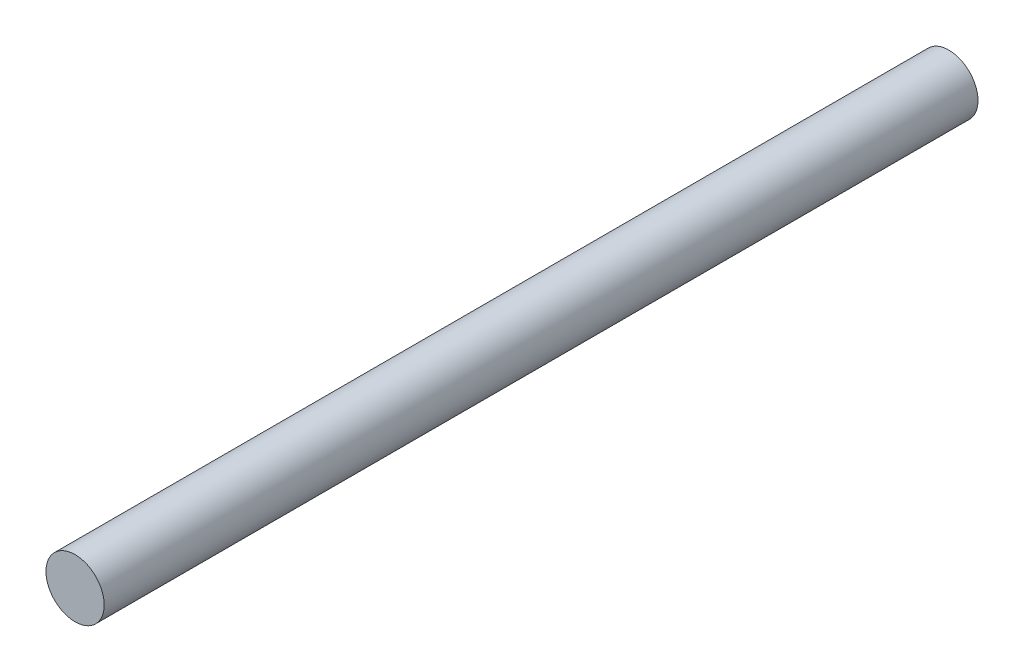
ISO-10303-21;
HEADER;
FILE_DESCRIPTION(('STEP AP214'),'2;1');
FILE_NAME('part.step','',(''),(''),'','','');
FILE_SCHEMA(('AUTOMOTIVE_DESIGN { 1 0 10303 214 1 1 1 1 }'));
ENDSEC;
DATA;
#1=APPLICATION_CONTEXT('core data for automotive mechanical design processes');
#2=APPLICATION_PROTOCOL_DEFINITION('international standard','automotive_design',2000,#1);
#3=PRODUCT_CONTEXT('',#1,'mechanical');
#4=PRODUCT('Part','Part','',(#3));
#5=PRODUCT_RELATED_PRODUCT_CATEGORY('part','',(#4));
#6=PRODUCT_DEFINITION_FORMATION('','',#4);
#7=PRODUCT_DEFINITION_CONTEXT('part definition',#1,'design');
#8=PRODUCT_DEFINITION('design','',#6,#7);
#9=PRODUCT_DEFINITION_SHAPE('','',#8);
#10=(LENGTH_UNIT() NAMED_UNIT(*) SI_UNIT(.MILLI.,.METRE.));
#11=(NAMED_UNIT(*) PLANE_ANGLE_UNIT() SI_UNIT($,.RADIAN.));
#12=(NAMED_UNIT(*) SI_UNIT($,.STERADIAN.) SOLID_ANGLE_UNIT());
#13=UNCERTAINTY_MEASURE_WITH_UNIT(LENGTH_MEASURE(1.E-05),#10,'distance_accuracy_value','');
#14=(GEOMETRIC_REPRESENTATION_CONTEXT(3) GLOBAL_UNCERTAINTY_ASSIGNED_CONTEXT((#13)) GLOBAL_UNIT_ASSIGNED_CONTEXT((#10,
#11,#12)) REPRESENTATION_CONTEXT('',''));
#15=CARTESIAN_POINT('',(0.,0.,0.));
#16=DIRECTION('',(0.,0.,1.));
#17=DIRECTION('',(1.,0.,0.));
#18=AXIS2_PLACEMENT_3D('',#15,#16,#17);
#19=CARTESIAN_POINT('',(0.,0.,45.));
#20=DIRECTION('',(0.,0.,-1.));
#21=DIRECTION('',(-1.,0.,0.));
#22=AXIS2_PLACEMENT_3D('',#19,#20,#21);
#23=CYLINDRICAL_SURFACE('',#22,1.5);
#24=CARTESIAN_POINT('',(0.,0.,45.));
#25=DIRECTION('',(0.,0.,1.));
#26=DIRECTION('',(1.,0.,0.));
#27=AXIS2_PLACEMENT_3D('',#24,#25,#26);
#28=CIRCLE('',#27,1.5);
#29=CARTESIAN_POINT('',(1.5,0.,45.));
#30=VERTEX_POINT('',#29);
#31=EDGE_CURVE('E10',#30,#30,#28,.T.);
#32=ORIENTED_EDGE('',*,*,#31,.F.);
#33=EDGE_LOOP('',(#32));
#34=FACE_BOUND('',#33,.T.);
#35=CARTESIAN_POINT('',(0.,0.,0.));
#36=DIRECTION('',(0.,0.,1.));
#37=DIRECTION('',(1.,0.,0.));
#38=AXIS2_PLACEMENT_3D('',#35,#36,#37);
#39=CIRCLE('',#38,1.5);
#40=CARTESIAN_POINT('',(1.5,0.,0.));
#41=VERTEX_POINT('',#40);
#42=EDGE_CURVE('E40',#41,#41,#39,.T.);
#43=ORIENTED_EDGE('',*,*,#42,.T.);
#44=EDGE_LOOP('',(#43));
#45=FACE_BOUND('',#44,.T.);
#46=ADVANCED_FACE('F37',(#34,#45),#23,.T.);
#47=CARTESIAN_POINT('',(0.,0.,45.));
#48=DIRECTION('',(0.,0.,1.));
#49=DIRECTION('',(1.,0.,0.));
#50=AXIS2_PLACEMENT_3D('',#47,#48,#49);
#51=PLANE('',#50);
#52=ORIENTED_EDGE('',*,*,#31,.T.);
#53=EDGE_LOOP('',(#52));
#54=FACE_BOUND('',#53,.T.);
#55=ADVANCED_FACE('F54',(#54),#51,.T.);
#56=CARTESIAN_POINT('',(0.,0.,0.));
#57=DIRECTION('',(0.,0.,1.));
#58=DIRECTION('',(1.,0.,0.));
#59=AXIS2_PLACEMENT_3D('',#56,#57,#58);
#60=PLANE('',#59);
#61=ORIENTED_EDGE('',*,*,#42,.F.);
#62=EDGE_LOOP('',(#61));
#63=FACE_BOUND('',#62,.T.);
#64=ADVANCED_FACE('F52',(#63),#60,.F.);
#65=CLOSED_SHELL('',(#46,#55,#64));
#66=MANIFOLD_SOLID_BREP('B2',#65);
#67=ADVANCED_BREP_SHAPE_REPRESENTATION('',(#18,#66),#14);
#68=SHAPE_DEFINITION_REPRESENTATION(#9,#67);
ENDSEC;
END-ISO-10303-21;
